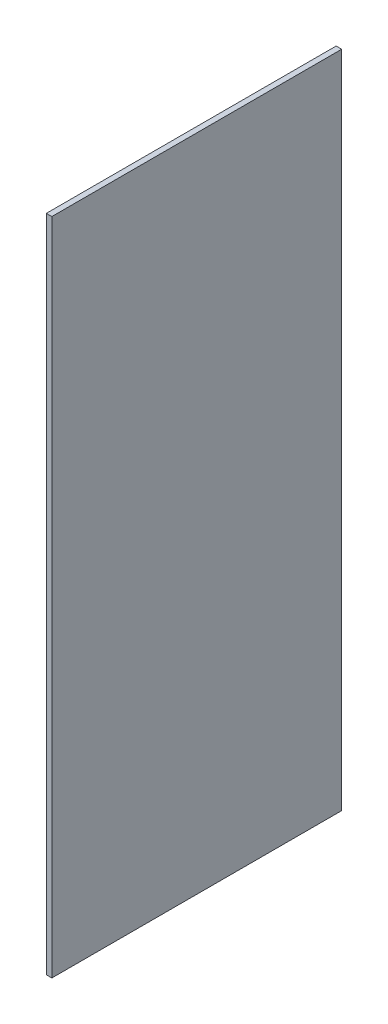
ISO-10303-21;
HEADER;
FILE_DESCRIPTION(('STEP AP214'),'2;1');
FILE_NAME('part.step','',(''),(''),'','','');
FILE_SCHEMA(('AUTOMOTIVE_DESIGN { 1 0 10303 214 1 1 1 1 }'));
ENDSEC;
DATA;
#1=APPLICATION_CONTEXT('core data for automotive mechanical design processes');
#2=APPLICATION_PROTOCOL_DEFINITION('international standard','automotive_design',2000,#1);
#3=PRODUCT_CONTEXT('',#1,'mechanical');
#4=PRODUCT('Part','Part','',(#3));
#5=PRODUCT_RELATED_PRODUCT_CATEGORY('part','',(#4));
#6=PRODUCT_DEFINITION_FORMATION('','',#4);
#7=PRODUCT_DEFINITION_CONTEXT('part definition',#1,'design');
#8=PRODUCT_DEFINITION('design','',#6,#7);
#9=PRODUCT_DEFINITION_SHAPE('','',#8);
#10=(LENGTH_UNIT() NAMED_UNIT(*) SI_UNIT(.MILLI.,.METRE.));
#11=(NAMED_UNIT(*) PLANE_ANGLE_UNIT() SI_UNIT($,.RADIAN.));
#12=(NAMED_UNIT(*) SI_UNIT($,.STERADIAN.) SOLID_ANGLE_UNIT());
#13=UNCERTAINTY_MEASURE_WITH_UNIT(LENGTH_MEASURE(1.E-05),#10,'distance_accuracy_value','');
#14=(GEOMETRIC_REPRESENTATION_CONTEXT(3) GLOBAL_UNCERTAINTY_ASSIGNED_CONTEXT((#13)) GLOBAL_UNIT_ASSIGNED_CONTEXT((#10,
#11,#12)) REPRESENTATION_CONTEXT('',''));
#15=CARTESIAN_POINT('',(0.,0.,0.));
#16=DIRECTION('',(0.,0.,1.));
#17=DIRECTION('',(1.,0.,0.));
#18=AXIS2_PLACEMENT_3D('',#15,#16,#17);
#19=CARTESIAN_POINT('',(1.21412,-72.23125,-31.75));
#20=DIRECTION('',(0.,0.,1.));
#21=DIRECTION('',(1.,0.,0.));
#22=AXIS2_PLACEMENT_3D('',#19,#20,#21);
#23=PLANE('',#22);
#24=DIRECTION('',(0.,1.,0.));
#25=VECTOR('',#24,1.);
#26=CARTESIAN_POINT('',(0.,-72.23125,-31.75));
#27=LINE('',#26,#25);
#28=CARTESIAN_POINT('',(0.,-72.23125,-31.75));
#29=VERTEX_POINT('',#28);
#30=CARTESIAN_POINT('',(0.,72.23125,-31.75));
#31=VERTEX_POINT('',#30);
#32=EDGE_CURVE('E111',#29,#31,#27,.T.);
#33=ORIENTED_EDGE('',*,*,#32,.T.);
#34=DIRECTION('',(-1.,0.,0.));
#35=VECTOR('',#34,1.);
#36=CARTESIAN_POINT('',(1.21412,72.23125,-31.75));
#37=LINE('',#36,#35);
#38=CARTESIAN_POINT('',(1.21412,72.23125,-31.75));
#39=VERTEX_POINT('',#38);
#40=EDGE_CURVE('E11',#39,#31,#37,.T.);
#41=ORIENTED_EDGE('',*,*,#40,.F.);
#42=DIRECTION('',(0.,1.,0.));
#43=VECTOR('',#42,1.);
#44=CARTESIAN_POINT('',(1.21412,-72.23125,-31.75));
#45=LINE('',#44,#43);
#46=CARTESIAN_POINT('',(1.21412,-72.23125,-31.75));
#47=VERTEX_POINT('',#46);
#48=EDGE_CURVE('E95',#47,#39,#45,.T.);
#49=ORIENTED_EDGE('',*,*,#48,.F.);
#50=DIRECTION('',(-1.,0.,0.));
#51=VECTOR('',#50,1.);
#52=CARTESIAN_POINT('',(1.21412,-72.23125,-31.75));
#53=LINE('',#52,#51);
#54=EDGE_CURVE('E107',#47,#29,#53,.T.);
#55=ORIENTED_EDGE('',*,*,#54,.T.);
#56=EDGE_LOOP('',(#33,#41,#49,#55));
#57=FACE_BOUND('',#56,.T.);
#58=ADVANCED_FACE('F43',(#57),#23,.F.);
#59=CARTESIAN_POINT('',(1.21412,72.23125,31.75));
#60=DIRECTION('',(0.,-1.,0.));
#61=DIRECTION('',(0.,0.,-1.));
#62=AXIS2_PLACEMENT_3D('',#59,#60,#61);
#63=PLANE('',#62);
#64=DIRECTION('',(0.,0.,1.));
#65=VECTOR('',#64,1.);
#66=CARTESIAN_POINT('',(0.,72.23125,31.75));
#67=LINE('',#66,#65);
#68=CARTESIAN_POINT('',(0.,72.23125,31.75));
#69=VERTEX_POINT('',#68);
#70=EDGE_CURVE('E100',#31,#69,#67,.T.);
#71=ORIENTED_EDGE('',*,*,#70,.T.);
#72=DIRECTION('',(-1.,0.,0.));
#73=VECTOR('',#72,1.);
#74=CARTESIAN_POINT('',(1.21412,72.23125,31.75));
#75=LINE('',#74,#73);
#76=CARTESIAN_POINT('',(1.21412,72.23125,31.75));
#77=VERTEX_POINT('',#76);
#78=EDGE_CURVE('E52',#77,#69,#75,.T.);
#79=ORIENTED_EDGE('',*,*,#78,.F.);
#80=DIRECTION('',(0.,0.,1.));
#81=VECTOR('',#80,1.);
#82=CARTESIAN_POINT('',(1.21412,72.23125,31.75));
#83=LINE('',#82,#81);
#84=EDGE_CURVE('E90',#39,#77,#83,.T.);
#85=ORIENTED_EDGE('',*,*,#84,.F.);
#86=ORIENTED_EDGE('',*,*,#40,.T.);
#87=EDGE_LOOP('',(#71,#79,#85,#86));
#88=FACE_BOUND('',#87,.T.);
#89=ADVANCED_FACE('F99',(#88),#63,.F.);
#90=CARTESIAN_POINT('',(1.21412,-72.23125,31.75));
#91=DIRECTION('',(0.,0.,-1.));
#92=DIRECTION('',(-1.,0.,0.));
#93=AXIS2_PLACEMENT_3D('',#90,#91,#92);
#94=PLANE('',#93);
#95=DIRECTION('',(0.,-1.,0.));
#96=VECTOR('',#95,1.);
#97=CARTESIAN_POINT('',(0.,-72.23125,31.75));
#98=LINE('',#97,#96);
#99=CARTESIAN_POINT('',(0.,-72.23125,31.75));
#100=VERTEX_POINT('',#99);
#101=EDGE_CURVE('E77',#69,#100,#98,.T.);
#102=ORIENTED_EDGE('',*,*,#101,.T.);
#103=DIRECTION('',(-1.,0.,0.));
#104=VECTOR('',#103,1.);
#105=CARTESIAN_POINT('',(1.21412,-72.23125,31.75));
#106=LINE('',#105,#104);
#107=CARTESIAN_POINT('',(1.21412,-72.23125,31.75));
#108=VERTEX_POINT('',#107);
#109=EDGE_CURVE('E102',#108,#100,#106,.T.);
#110=ORIENTED_EDGE('',*,*,#109,.F.);
#111=DIRECTION('',(0.,-1.,0.));
#112=VECTOR('',#111,1.);
#113=CARTESIAN_POINT('',(1.21412,-72.23125,31.75));
#114=LINE('',#113,#112);
#115=EDGE_CURVE('E93',#77,#108,#114,.T.);
#116=ORIENTED_EDGE('',*,*,#115,.F.);
#117=ORIENTED_EDGE('',*,*,#78,.T.);
#118=EDGE_LOOP('',(#102,#110,#116,#117));
#119=FACE_BOUND('',#118,.T.);
#120=ADVANCED_FACE('F103',(#119),#94,.F.);
#121=CARTESIAN_POINT('',(1.21412,-72.23125,31.75));
#122=DIRECTION('',(0.,1.,0.));
#123=DIRECTION('',(0.,0.,1.));
#124=AXIS2_PLACEMENT_3D('',#121,#122,#123);
#125=PLANE('',#124);
#126=DIRECTION('',(0.,0.,-1.));
#127=VECTOR('',#126,1.);
#128=CARTESIAN_POINT('',(0.,-72.23125,31.75));
#129=LINE('',#128,#127);
#130=EDGE_CURVE('E83',#100,#29,#129,.T.);
#131=ORIENTED_EDGE('',*,*,#130,.T.);
#132=ORIENTED_EDGE('',*,*,#54,.F.);
#133=DIRECTION('',(0.,0.,-1.));
#134=VECTOR('',#133,1.);
#135=CARTESIAN_POINT('',(1.21412,-72.23125,31.75));
#136=LINE('',#135,#134);
#137=EDGE_CURVE('E60',#108,#47,#136,.T.);
#138=ORIENTED_EDGE('',*,*,#137,.F.);
#139=ORIENTED_EDGE('',*,*,#109,.T.);
#140=EDGE_LOOP('',(#131,#132,#138,#139));
#141=FACE_BOUND('',#140,.T.);
#142=ADVANCED_FACE('F124',(#141),#125,.F.);
#143=CARTESIAN_POINT('',(1.21412,0.,0.));
#144=DIRECTION('',(-1.,0.,0.));
#145=DIRECTION('',(0.,0.,1.));
#146=AXIS2_PLACEMENT_3D('',#143,#144,#145);
#147=PLANE('',#146);
#148=ORIENTED_EDGE('',*,*,#48,.T.);
#149=ORIENTED_EDGE('',*,*,#84,.T.);
#150=ORIENTED_EDGE('',*,*,#115,.T.);
#151=ORIENTED_EDGE('',*,*,#137,.T.);
#152=EDGE_LOOP('',(#148,#149,#150,#151));
#153=FACE_BOUND('',#152,.T.);
#154=ADVANCED_FACE('F91',(#153),#147,.F.);
#155=CARTESIAN_POINT('',(0.,0.,0.));
#156=DIRECTION('',(-1.,0.,0.));
#157=DIRECTION('',(0.,0.,1.));
#158=AXIS2_PLACEMENT_3D('',#155,#156,#157);
#159=PLANE('',#158);
#160=ORIENTED_EDGE('',*,*,#32,.F.);
#161=ORIENTED_EDGE('',*,*,#130,.F.);
#162=ORIENTED_EDGE('',*,*,#101,.F.);
#163=ORIENTED_EDGE('',*,*,#70,.F.);
#164=EDGE_LOOP('',(#160,#161,#162,#163));
#165=FACE_BOUND('',#164,.T.);
#166=ADVANCED_FACE('F127',(#165),#159,.T.);
#167=CLOSED_SHELL('',(#58,#89,#120,#142,#154,#166));
#168=MANIFOLD_SOLID_BREP('B2',#167);
#169=ADVANCED_BREP_SHAPE_REPRESENTATION('',(#18,#168),#14);
#170=SHAPE_DEFINITION_REPRESENTATION(#9,#169);
ENDSEC;
END-ISO-10303-21;
